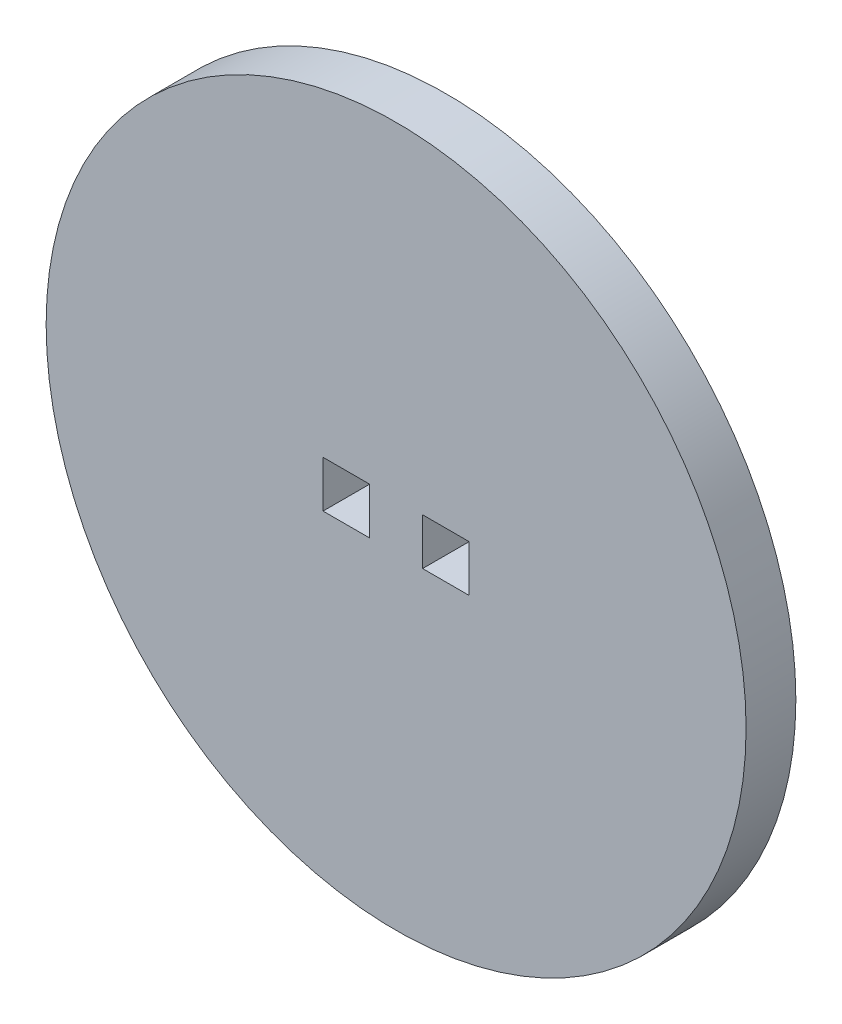
ISO-10303-21;
HEADER;
FILE_DESCRIPTION(('STEP AP214'),'2;1');
FILE_NAME('part.step','',(''),(''),'','','');
FILE_SCHEMA(('AUTOMOTIVE_DESIGN { 1 0 10303 214 1 1 1 1 }'));
ENDSEC;
DATA;
#1=APPLICATION_CONTEXT('core data for automotive mechanical design processes');
#2=APPLICATION_PROTOCOL_DEFINITION('international standard','automotive_design',2000,#1);
#3=PRODUCT_CONTEXT('',#1,'mechanical');
#4=PRODUCT('Part','Part','',(#3));
#5=PRODUCT_RELATED_PRODUCT_CATEGORY('part','',(#4));
#6=PRODUCT_DEFINITION_FORMATION('','',#4);
#7=PRODUCT_DEFINITION_CONTEXT('part definition',#1,'design');
#8=PRODUCT_DEFINITION('design','',#6,#7);
#9=PRODUCT_DEFINITION_SHAPE('','',#8);
#10=(LENGTH_UNIT() NAMED_UNIT(*) SI_UNIT(.MILLI.,.METRE.));
#11=(NAMED_UNIT(*) PLANE_ANGLE_UNIT() SI_UNIT($,.RADIAN.));
#12=(NAMED_UNIT(*) SI_UNIT($,.STERADIAN.) SOLID_ANGLE_UNIT());
#13=UNCERTAINTY_MEASURE_WITH_UNIT(LENGTH_MEASURE(1.E-05),#10,'distance_accuracy_value','');
#14=(GEOMETRIC_REPRESENTATION_CONTEXT(3) GLOBAL_UNCERTAINTY_ASSIGNED_CONTEXT((#13)) GLOBAL_UNIT_ASSIGNED_CONTEXT((#10,
#11,#12)) REPRESENTATION_CONTEXT('',''));
#15=CARTESIAN_POINT('',(0.,0.,0.));
#16=DIRECTION('',(0.,0.,1.));
#17=DIRECTION('',(1.,0.,0.));
#18=AXIS2_PLACEMENT_3D('',#15,#16,#17);
#19=CARTESIAN_POINT('',(0.,0.,3.175));
#20=DIRECTION('',(0.,0.,1.));
#21=DIRECTION('',(1.,0.,0.));
#22=AXIS2_PLACEMENT_3D('',#19,#20,#21);
#23=PLANE('',#22);
#24=CARTESIAN_POINT('',(0.,0.,3.175));
#25=DIRECTION('',(0.,0.,1.));
#26=DIRECTION('',(1.,0.,0.));
#27=AXIS2_PLACEMENT_3D('',#24,#25,#26);
#28=CIRCLE('',#27,22.3266);
#29=CARTESIAN_POINT('',(22.3266,0.,3.175));
#30=VERTEX_POINT('',#29);
#31=EDGE_CURVE('E12',#30,#30,#28,.T.);
#32=ORIENTED_EDGE('',*,*,#31,.T.);
#33=EDGE_LOOP('',(#32));
#34=FACE_BOUND('',#33,.T.);
#35=DIRECTION('',(0.,-1.,0.));
#36=VECTOR('',#35,1.);
#37=CARTESIAN_POINT('',(-4.6609,1.4859,3.175));
#38=LINE('',#37,#36);
#39=CARTESIAN_POINT('',(-4.6609,1.4859,3.175));
#40=VERTEX_POINT('',#39);
#41=CARTESIAN_POINT('',(-4.6609,-1.4859,3.175));
#42=VERTEX_POINT('',#41);
#43=EDGE_CURVE('E155',#40,#42,#38,.T.);
#44=ORIENTED_EDGE('',*,*,#43,.F.);
#45=DIRECTION('',(-1.,0.,0.));
#46=VECTOR('',#45,1.);
#47=CARTESIAN_POINT('',(-4.6609,1.4859,3.175));
#48=LINE('',#47,#46);
#49=CARTESIAN_POINT('',(-1.6891,1.4859,3.175));
#50=VERTEX_POINT('',#49);
#51=EDGE_CURVE('E151',#50,#40,#48,.T.);
#52=ORIENTED_EDGE('',*,*,#51,.F.);
#53=DIRECTION('',(0.,1.,0.));
#54=VECTOR('',#53,1.);
#55=CARTESIAN_POINT('',(-1.6891,1.4859,3.175));
#56=LINE('',#55,#54);
#57=CARTESIAN_POINT('',(-1.6891,-1.4859,3.175));
#58=VERTEX_POINT('',#57);
#59=EDGE_CURVE('E162',#58,#50,#56,.T.);
#60=ORIENTED_EDGE('',*,*,#59,.F.);
#61=DIRECTION('',(1.,0.,0.));
#62=VECTOR('',#61,1.);
#63=CARTESIAN_POINT('',(-4.6609,-1.4859,3.175));
#64=LINE('',#63,#62);
#65=EDGE_CURVE('E167',#42,#58,#64,.T.);
#66=ORIENTED_EDGE('',*,*,#65,.F.);
#67=EDGE_LOOP('',(#44,#52,#60,#66));
#68=FACE_BOUND('',#67,.T.);
#69=DIRECTION('',(0.,1.,0.));
#70=VECTOR('',#69,1.);
#71=CARTESIAN_POINT('',(4.6609,-1.4859,3.175));
#72=LINE('',#71,#70);
#73=CARTESIAN_POINT('',(4.6609,-1.4859,3.175));
#74=VERTEX_POINT('',#73);
#75=CARTESIAN_POINT('',(4.6609,1.4859,3.175));
#76=VERTEX_POINT('',#75);
#77=EDGE_CURVE('E111',#74,#76,#72,.T.);
#78=ORIENTED_EDGE('',*,*,#77,.F.);
#79=DIRECTION('',(1.,0.,0.));
#80=VECTOR('',#79,1.);
#81=CARTESIAN_POINT('',(1.6891,-1.4859,3.175));
#82=LINE('',#81,#80);
#83=CARTESIAN_POINT('',(1.6891,-1.4859,3.175));
#84=VERTEX_POINT('',#83);
#85=EDGE_CURVE('E102',#84,#74,#82,.T.);
#86=ORIENTED_EDGE('',*,*,#85,.F.);
#87=DIRECTION('',(0.,-1.,0.));
#88=VECTOR('',#87,1.);
#89=CARTESIAN_POINT('',(1.6891,-1.4859,3.175));
#90=LINE('',#89,#88);
#91=CARTESIAN_POINT('',(1.6891,1.4859,3.175));
#92=VERTEX_POINT('',#91);
#93=EDGE_CURVE('E128',#92,#84,#90,.T.);
#94=ORIENTED_EDGE('',*,*,#93,.F.);
#95=DIRECTION('',(-1.,0.,0.));
#96=VECTOR('',#95,1.);
#97=CARTESIAN_POINT('',(1.6891,1.4859,3.175));
#98=LINE('',#97,#96);
#99=EDGE_CURVE('E123',#76,#92,#98,.T.);
#100=ORIENTED_EDGE('',*,*,#99,.F.);
#101=EDGE_LOOP('',(#78,#86,#94,#100));
#102=FACE_BOUND('',#101,.T.);
#103=ADVANCED_FACE('F36',(#34,#68,#102),#23,.T.);
#104=CARTESIAN_POINT('',(0.,0.,0.));
#105=DIRECTION('',(0.,0.,1.));
#106=DIRECTION('',(1.,0.,0.));
#107=AXIS2_PLACEMENT_3D('',#104,#105,#106);
#108=PLANE('',#107);
#109=DIRECTION('',(-1.,0.,0.));
#110=VECTOR('',#109,1.);
#111=CARTESIAN_POINT('',(-4.6609,1.4859,0.));
#112=LINE('',#111,#110);
#113=CARTESIAN_POINT('',(-1.6891,1.4859,0.));
#114=VERTEX_POINT('',#113);
#115=CARTESIAN_POINT('',(-4.6609,1.4859,0.));
#116=VERTEX_POINT('',#115);
#117=EDGE_CURVE('E119',#114,#116,#112,.T.);
#118=ORIENTED_EDGE('',*,*,#117,.T.);
#119=DIRECTION('',(0.,-1.,0.));
#120=VECTOR('',#119,1.);
#121=CARTESIAN_POINT('',(-4.6609,1.4859,0.));
#122=LINE('',#121,#120);
#123=CARTESIAN_POINT('',(-4.6609,-1.4859,0.));
#124=VERTEX_POINT('',#123);
#125=EDGE_CURVE('E171',#116,#124,#122,.T.);
#126=ORIENTED_EDGE('',*,*,#125,.T.);
#127=DIRECTION('',(1.,0.,0.));
#128=VECTOR('',#127,1.);
#129=CARTESIAN_POINT('',(-4.6609,-1.4859,0.));
#130=LINE('',#129,#128);
#131=CARTESIAN_POINT('',(-1.6891,-1.4859,0.));
#132=VERTEX_POINT('',#131);
#133=EDGE_CURVE('E174',#124,#132,#130,.T.);
#134=ORIENTED_EDGE('',*,*,#133,.T.);
#135=DIRECTION('',(0.,1.,0.));
#136=VECTOR('',#135,1.);
#137=CARTESIAN_POINT('',(-1.6891,1.4859,0.));
#138=LINE('',#137,#136);
#139=EDGE_CURVE('E156',#132,#114,#138,.T.);
#140=ORIENTED_EDGE('',*,*,#139,.T.);
#141=EDGE_LOOP('',(#118,#126,#134,#140));
#142=FACE_BOUND('',#141,.T.);
#143=CARTESIAN_POINT('',(0.,0.,0.));
#144=DIRECTION('',(0.,0.,1.));
#145=DIRECTION('',(1.,0.,0.));
#146=AXIS2_PLACEMENT_3D('',#143,#144,#145);
#147=CIRCLE('',#146,22.3266);
#148=CARTESIAN_POINT('',(22.3266,0.,0.));
#149=VERTEX_POINT('',#148);
#150=EDGE_CURVE('E40',#149,#149,#147,.T.);
#151=ORIENTED_EDGE('',*,*,#150,.F.);
#152=EDGE_LOOP('',(#151));
#153=FACE_BOUND('',#152,.T.);
#154=DIRECTION('',(1.,0.,0.));
#155=VECTOR('',#154,1.);
#156=CARTESIAN_POINT('',(1.6891,-1.4859,0.));
#157=LINE('',#156,#155);
#158=CARTESIAN_POINT('',(1.6891,-1.4859,0.));
#159=VERTEX_POINT('',#158);
#160=CARTESIAN_POINT('',(4.6609,-1.4859,0.));
#161=VERTEX_POINT('',#160);
#162=EDGE_CURVE('E60',#159,#161,#157,.T.);
#163=ORIENTED_EDGE('',*,*,#162,.T.);
#164=DIRECTION('',(0.,1.,0.));
#165=VECTOR('',#164,1.);
#166=CARTESIAN_POINT('',(4.6609,-1.4859,0.));
#167=LINE('',#166,#165);
#168=CARTESIAN_POINT('',(4.6609,1.4859,0.));
#169=VERTEX_POINT('',#168);
#170=EDGE_CURVE('E118',#161,#169,#167,.T.);
#171=ORIENTED_EDGE('',*,*,#170,.T.);
#172=DIRECTION('',(-1.,0.,0.));
#173=VECTOR('',#172,1.);
#174=CARTESIAN_POINT('',(1.6891,1.4859,0.));
#175=LINE('',#174,#173);
#176=CARTESIAN_POINT('',(1.6891,1.4859,0.));
#177=VERTEX_POINT('',#176);
#178=EDGE_CURVE('E143',#169,#177,#175,.T.);
#179=ORIENTED_EDGE('',*,*,#178,.T.);
#180=DIRECTION('',(0.,-1.,0.));
#181=VECTOR('',#180,1.);
#182=CARTESIAN_POINT('',(1.6891,-1.4859,0.));
#183=LINE('',#182,#181);
#184=EDGE_CURVE('E112',#177,#159,#183,.T.);
#185=ORIENTED_EDGE('',*,*,#184,.T.);
#186=EDGE_LOOP('',(#163,#171,#179,#185));
#187=FACE_BOUND('',#186,.T.);
#188=ADVANCED_FACE('F194',(#142,#153,#187),#108,.F.);
#189=CARTESIAN_POINT('',(0.,0.,3.175));
#190=DIRECTION('',(0.,0.,-1.));
#191=DIRECTION('',(-1.,0.,0.));
#192=AXIS2_PLACEMENT_3D('',#189,#190,#191);
#193=CYLINDRICAL_SURFACE('',#192,22.3266);
#194=ORIENTED_EDGE('',*,*,#31,.F.);
#195=EDGE_LOOP('',(#194));
#196=FACE_BOUND('',#195,.T.);
#197=ORIENTED_EDGE('',*,*,#150,.T.);
#198=EDGE_LOOP('',(#197));
#199=FACE_BOUND('',#198,.T.);
#200=ADVANCED_FACE('F38',(#196,#199),#193,.T.);
#201=CARTESIAN_POINT('',(-4.6609,1.4859,3.175));
#202=DIRECTION('',(0.,-1.,0.));
#203=DIRECTION('',(0.,0.,-1.));
#204=AXIS2_PLACEMENT_3D('',#201,#202,#203);
#205=PLANE('',#204);
#206=ORIENTED_EDGE('',*,*,#117,.F.);
#207=DIRECTION('',(0.,0.,-1.));
#208=VECTOR('',#207,1.);
#209=CARTESIAN_POINT('',(-1.6891,1.4859,3.175));
#210=LINE('',#209,#208);
#211=EDGE_CURVE('E166',#50,#114,#210,.T.);
#212=ORIENTED_EDGE('',*,*,#211,.F.);
#213=ORIENTED_EDGE('',*,*,#51,.T.);
#214=DIRECTION('',(0.,0.,-1.));
#215=VECTOR('',#214,1.);
#216=CARTESIAN_POINT('',(-4.6609,1.4859,3.175));
#217=LINE('',#216,#215);
#218=EDGE_CURVE('E185',#40,#116,#217,.T.);
#219=ORIENTED_EDGE('',*,*,#218,.T.);
#220=EDGE_LOOP('',(#206,#212,#213,#219));
#221=FACE_BOUND('',#220,.T.);
#222=ADVANCED_FACE('F215',(#221),#205,.T.);
#223=CARTESIAN_POINT('',(-4.6609,1.4859,3.175));
#224=DIRECTION('',(1.,0.,0.));
#225=DIRECTION('',(0.,0.,-1.));
#226=AXIS2_PLACEMENT_3D('',#223,#224,#225);
#227=PLANE('',#226);
#228=ORIENTED_EDGE('',*,*,#125,.F.);
#229=ORIENTED_EDGE('',*,*,#218,.F.);
#230=ORIENTED_EDGE('',*,*,#43,.T.);
#231=DIRECTION('',(0.,0.,-1.));
#232=VECTOR('',#231,1.);
#233=CARTESIAN_POINT('',(-4.6609,-1.4859,3.175));
#234=LINE('',#233,#232);
#235=EDGE_CURVE('E183',#42,#124,#234,.T.);
#236=ORIENTED_EDGE('',*,*,#235,.T.);
#237=EDGE_LOOP('',(#228,#229,#230,#236));
#238=FACE_BOUND('',#237,.T.);
#239=ADVANCED_FACE('F218',(#238),#227,.T.);
#240=CARTESIAN_POINT('',(-4.6609,-1.4859,3.175));
#241=DIRECTION('',(0.,1.,0.));
#242=DIRECTION('',(-1.,0.,0.));
#243=AXIS2_PLACEMENT_3D('',#240,#241,#242);
#244=PLANE('',#243);
#245=ORIENTED_EDGE('',*,*,#133,.F.);
#246=ORIENTED_EDGE('',*,*,#235,.F.);
#247=ORIENTED_EDGE('',*,*,#65,.T.);
#248=DIRECTION('',(0.,0.,-1.));
#249=VECTOR('',#248,1.);
#250=CARTESIAN_POINT('',(-1.6891,-1.4859,3.175));
#251=LINE('',#250,#249);
#252=EDGE_CURVE('E181',#58,#132,#251,.T.);
#253=ORIENTED_EDGE('',*,*,#252,.T.);
#254=EDGE_LOOP('',(#245,#246,#247,#253));
#255=FACE_BOUND('',#254,.T.);
#256=ADVANCED_FACE('F221',(#255),#244,.T.);
#257=CARTESIAN_POINT('',(-1.6891,1.4859,3.175));
#258=DIRECTION('',(-1.,0.,0.));
#259=DIRECTION('',(0.,-1.,0.));
#260=AXIS2_PLACEMENT_3D('',#257,#258,#259);
#261=PLANE('',#260);
#262=ORIENTED_EDGE('',*,*,#139,.F.);
#263=ORIENTED_EDGE('',*,*,#252,.F.);
#264=ORIENTED_EDGE('',*,*,#59,.T.);
#265=ORIENTED_EDGE('',*,*,#211,.T.);
#266=EDGE_LOOP('',(#262,#263,#264,#265));
#267=FACE_BOUND('',#266,.T.);
#268=ADVANCED_FACE('F225',(#267),#261,.T.);
#269=CARTESIAN_POINT('',(1.6891,-1.4859,3.175));
#270=DIRECTION('',(0.,1.,0.));
#271=DIRECTION('',(0.,0.,1.));
#272=AXIS2_PLACEMENT_3D('',#269,#270,#271);
#273=PLANE('',#272);
#274=ORIENTED_EDGE('',*,*,#162,.F.);
#275=DIRECTION('',(0.,0.,-1.));
#276=VECTOR('',#275,1.);
#277=CARTESIAN_POINT('',(1.6891,-1.4859,3.175));
#278=LINE('',#277,#276);
#279=EDGE_CURVE('E106',#84,#159,#278,.T.);
#280=ORIENTED_EDGE('',*,*,#279,.F.);
#281=ORIENTED_EDGE('',*,*,#85,.T.);
#282=DIRECTION('',(0.,0.,-1.));
#283=VECTOR('',#282,1.);
#284=CARTESIAN_POINT('',(4.6609,-1.4859,3.175));
#285=LINE('',#284,#283);
#286=EDGE_CURVE('E105',#74,#161,#285,.T.);
#287=ORIENTED_EDGE('',*,*,#286,.T.);
#288=EDGE_LOOP('',(#274,#280,#281,#287));
#289=FACE_BOUND('',#288,.T.);
#290=ADVANCED_FACE('F104',(#289),#273,.T.);
#291=CARTESIAN_POINT('',(4.6609,-1.4859,3.175));
#292=DIRECTION('',(-1.,0.,0.));
#293=DIRECTION('',(0.,0.,1.));
#294=AXIS2_PLACEMENT_3D('',#291,#292,#293);
#295=PLANE('',#294);
#296=ORIENTED_EDGE('',*,*,#170,.F.);
#297=ORIENTED_EDGE('',*,*,#286,.F.);
#298=ORIENTED_EDGE('',*,*,#77,.T.);
#299=DIRECTION('',(0.,0.,-1.));
#300=VECTOR('',#299,1.);
#301=CARTESIAN_POINT('',(4.6609,1.4859,3.175));
#302=LINE('',#301,#300);
#303=EDGE_CURVE('E120',#76,#169,#302,.T.);
#304=ORIENTED_EDGE('',*,*,#303,.T.);
#305=EDGE_LOOP('',(#296,#297,#298,#304));
#306=FACE_BOUND('',#305,.T.);
#307=ADVANCED_FACE('F115',(#306),#295,.T.);
#308=CARTESIAN_POINT('',(1.6891,1.4859,3.175));
#309=DIRECTION('',(0.,-1.,0.));
#310=DIRECTION('',(1.,0.,0.));
#311=AXIS2_PLACEMENT_3D('',#308,#309,#310);
#312=PLANE('',#311);
#313=ORIENTED_EDGE('',*,*,#178,.F.);
#314=ORIENTED_EDGE('',*,*,#303,.F.);
#315=ORIENTED_EDGE('',*,*,#99,.T.);
#316=DIRECTION('',(0.,0.,-1.));
#317=VECTOR('',#316,1.);
#318=CARTESIAN_POINT('',(1.6891,1.4859,3.175));
#319=LINE('',#318,#317);
#320=EDGE_CURVE('E52',#92,#177,#319,.T.);
#321=ORIENTED_EDGE('',*,*,#320,.T.);
#322=EDGE_LOOP('',(#313,#314,#315,#321));
#323=FACE_BOUND('',#322,.T.);
#324=ADVANCED_FACE('F201',(#323),#312,.T.);
#325=CARTESIAN_POINT('',(1.6891,-1.4859,3.175));
#326=DIRECTION('',(1.,0.,0.));
#327=DIRECTION('',(0.,0.,-1.));
#328=AXIS2_PLACEMENT_3D('',#325,#326,#327);
#329=PLANE('',#328);
#330=ORIENTED_EDGE('',*,*,#184,.F.);
#331=ORIENTED_EDGE('',*,*,#320,.F.);
#332=ORIENTED_EDGE('',*,*,#93,.T.);
#333=ORIENTED_EDGE('',*,*,#279,.T.);
#334=EDGE_LOOP('',(#330,#331,#332,#333));
#335=FACE_BOUND('',#334,.T.);
#336=ADVANCED_FACE('F199',(#335),#329,.T.);
#337=CLOSED_SHELL('',(#103,#188,#200,#222,#239,#256,#268,#290,#307,#324,#336));
#338=MANIFOLD_SOLID_BREP('B2',#337);
#339=ADVANCED_BREP_SHAPE_REPRESENTATION('',(#18,#338),#14);
#340=SHAPE_DEFINITION_REPRESENTATION(#9,#339);
ENDSEC;
END-ISO-10303-21;
